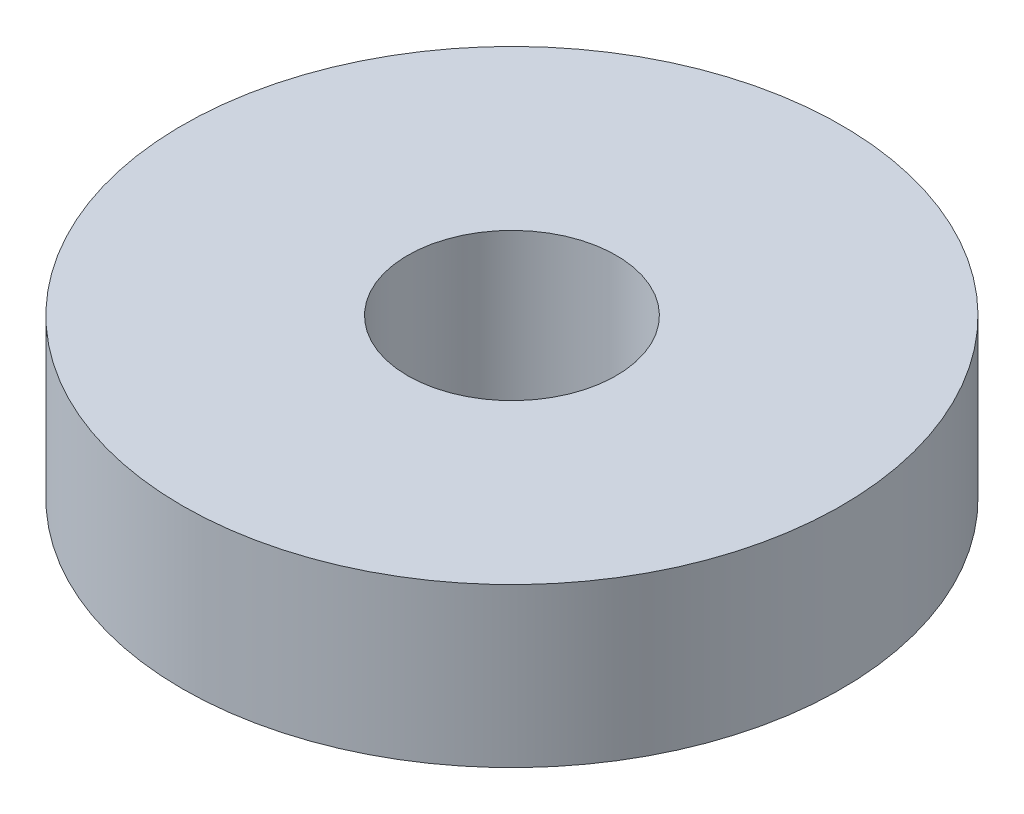
ISO-10303-21;
HEADER;
FILE_DESCRIPTION(('STEP AP214'),'2;1');
FILE_NAME('part.step','',(''),(''),'','','');
FILE_SCHEMA(('AUTOMOTIVE_DESIGN { 1 0 10303 214 1 1 1 1 }'));
ENDSEC;
DATA;
#1=APPLICATION_CONTEXT('core data for automotive mechanical design processes');
#2=APPLICATION_PROTOCOL_DEFINITION('international standard','automotive_design',2000,#1);
#3=PRODUCT_CONTEXT('',#1,'mechanical');
#4=PRODUCT('Part','Part','',(#3));
#5=PRODUCT_RELATED_PRODUCT_CATEGORY('part','',(#4));
#6=PRODUCT_DEFINITION_FORMATION('','',#4);
#7=PRODUCT_DEFINITION_CONTEXT('part definition',#1,'design');
#8=PRODUCT_DEFINITION('design','',#6,#7);
#9=PRODUCT_DEFINITION_SHAPE('','',#8);
#10=(LENGTH_UNIT() NAMED_UNIT(*) SI_UNIT(.MILLI.,.METRE.));
#11=(NAMED_UNIT(*) PLANE_ANGLE_UNIT() SI_UNIT($,.RADIAN.));
#12=(NAMED_UNIT(*) SI_UNIT($,.STERADIAN.) SOLID_ANGLE_UNIT());
#13=UNCERTAINTY_MEASURE_WITH_UNIT(LENGTH_MEASURE(1.E-05),#10,'distance_accuracy_value','');
#14=(GEOMETRIC_REPRESENTATION_CONTEXT(3) GLOBAL_UNCERTAINTY_ASSIGNED_CONTEXT((#13)) GLOBAL_UNIT_ASSIGNED_CONTEXT((#10,
#11,#12)) REPRESENTATION_CONTEXT('',''));
#15=CARTESIAN_POINT('',(0.,0.,0.));
#16=DIRECTION('',(0.,0.,1.));
#17=DIRECTION('',(1.,0.,0.));
#18=AXIS2_PLACEMENT_3D('',#15,#16,#17);
#19=CARTESIAN_POINT('',(0.,1.9,0.));
#20=DIRECTION('',(0.,1.,0.));
#21=DIRECTION('',(0.,0.,1.));
#22=AXIS2_PLACEMENT_3D('',#19,#20,#21);
#23=PLANE('',#22);
#24=CARTESIAN_POINT('',(0.,1.9,0.));
#25=DIRECTION('',(0.,1.,0.));
#26=DIRECTION('',(0.,0.,1.));
#27=AXIS2_PLACEMENT_3D('',#24,#25,#26);
#28=CIRCLE('',#27,3.95);
#29=CARTESIAN_POINT('',(0.,1.9,3.95));
#30=VERTEX_POINT('',#29);
#31=EDGE_CURVE('E10',#30,#30,#28,.T.);
#32=ORIENTED_EDGE('',*,*,#31,.T.);
#33=EDGE_LOOP('',(#32));
#34=FACE_BOUND('',#33,.T.);
#35=CARTESIAN_POINT('',(0.,1.9,0.));
#36=DIRECTION('',(0.,1.,0.));
#37=DIRECTION('',(0.,0.,1.));
#38=AXIS2_PLACEMENT_3D('',#35,#36,#37);
#39=CIRCLE('',#38,1.25);
#40=CARTESIAN_POINT('',(0.,1.9,1.25));
#41=VERTEX_POINT('',#40);
#42=EDGE_CURVE('E48',#41,#41,#39,.T.);
#43=ORIENTED_EDGE('',*,*,#42,.F.);
#44=EDGE_LOOP('',(#43));
#45=FACE_BOUND('',#44,.T.);
#46=ADVANCED_FACE('F40',(#34,#45),#23,.T.);
#47=CARTESIAN_POINT('',(0.,0.,0.));
#48=DIRECTION('',(0.,1.,0.));
#49=DIRECTION('',(0.,0.,1.));
#50=AXIS2_PLACEMENT_3D('',#47,#48,#49);
#51=PLANE('',#50);
#52=CARTESIAN_POINT('',(0.,0.,0.));
#53=DIRECTION('',(0.,1.,0.));
#54=DIRECTION('',(0.,0.,1.));
#55=AXIS2_PLACEMENT_3D('',#52,#53,#54);
#56=CIRCLE('',#55,3.95);
#57=CARTESIAN_POINT('',(0.,0.,3.95));
#58=VERTEX_POINT('',#57);
#59=EDGE_CURVE('E41',#58,#58,#56,.T.);
#60=ORIENTED_EDGE('',*,*,#59,.F.);
#61=EDGE_LOOP('',(#60));
#62=FACE_BOUND('',#61,.T.);
#63=CARTESIAN_POINT('',(0.,0.,0.));
#64=DIRECTION('',(0.,1.,0.));
#65=DIRECTION('',(0.,0.,1.));
#66=AXIS2_PLACEMENT_3D('',#63,#64,#65);
#67=CIRCLE('',#66,1.25);
#68=CARTESIAN_POINT('',(0.,0.,1.25));
#69=VERTEX_POINT('',#68);
#70=EDGE_CURVE('E49',#69,#69,#67,.T.);
#71=ORIENTED_EDGE('',*,*,#70,.T.);
#72=EDGE_LOOP('',(#71));
#73=FACE_BOUND('',#72,.T.);
#74=ADVANCED_FACE('F58',(#62,#73),#51,.F.);
#75=CARTESIAN_POINT('',(0.,1.9,0.));
#76=DIRECTION('',(0.,-1.,0.));
#77=DIRECTION('',(0.,0.,-1.));
#78=AXIS2_PLACEMENT_3D('',#75,#76,#77);
#79=CYLINDRICAL_SURFACE('',#78,3.95);
#80=ORIENTED_EDGE('',*,*,#31,.F.);
#81=EDGE_LOOP('',(#80));
#82=FACE_BOUND('',#81,.T.);
#83=ORIENTED_EDGE('',*,*,#59,.T.);
#84=EDGE_LOOP('',(#83));
#85=FACE_BOUND('',#84,.T.);
#86=ADVANCED_FACE('F39',(#82,#85),#79,.T.);
#87=CARTESIAN_POINT('',(0.,1.9,0.));
#88=DIRECTION('',(0.,-1.,0.));
#89=DIRECTION('',(0.,0.,-1.));
#90=AXIS2_PLACEMENT_3D('',#87,#88,#89);
#91=CYLINDRICAL_SURFACE('',#90,1.25);
#92=ORIENTED_EDGE('',*,*,#42,.T.);
#93=EDGE_LOOP('',(#92));
#94=FACE_BOUND('',#93,.T.);
#95=ORIENTED_EDGE('',*,*,#70,.F.);
#96=EDGE_LOOP('',(#95));
#97=FACE_BOUND('',#96,.T.);
#98=ADVANCED_FACE('F57',(#94,#97),#91,.F.);
#99=CLOSED_SHELL('',(#46,#74,#86,#98));
#100=MANIFOLD_SOLID_BREP('B2',#99);
#101=ADVANCED_BREP_SHAPE_REPRESENTATION('',(#18,#100),#14);
#102=SHAPE_DEFINITION_REPRESENTATION(#9,#101);
ENDSEC;
END-ISO-10303-21;
